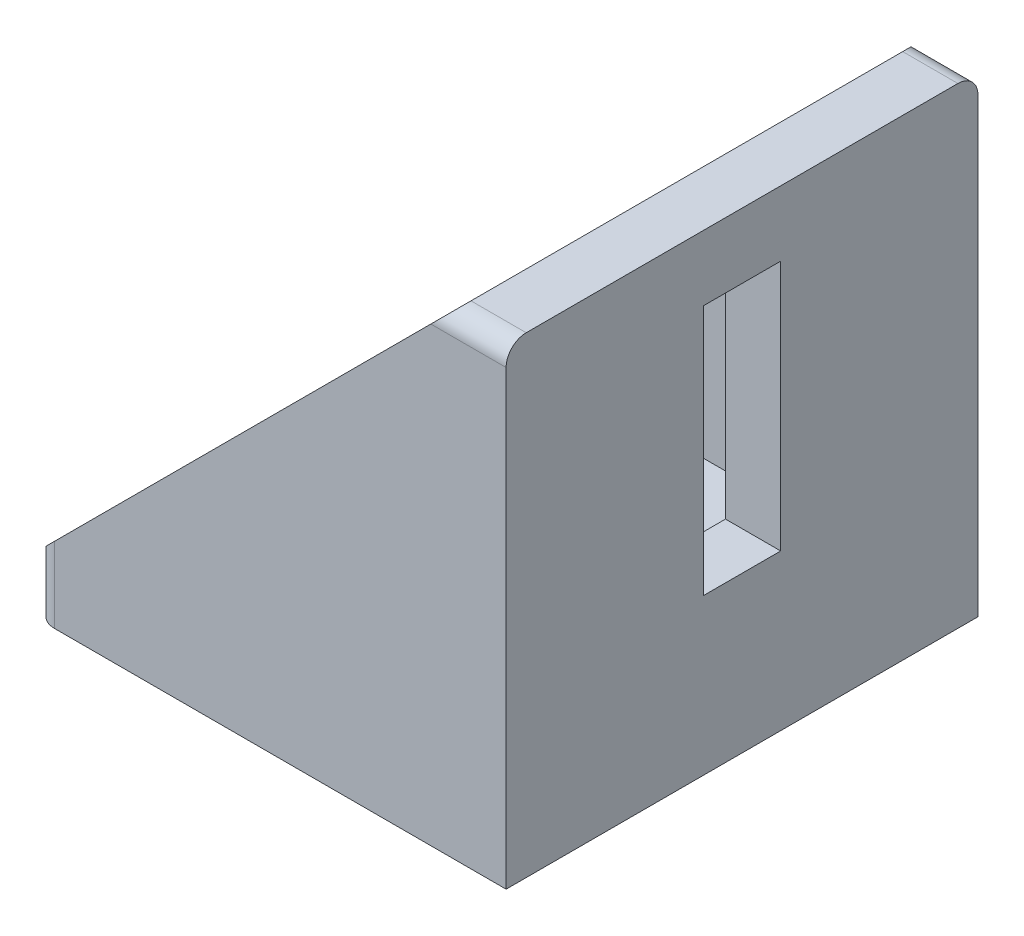
ISO-10303-21;
HEADER;
FILE_DESCRIPTION(('STEP AP214'),'2;1');
FILE_NAME('part.step','',(''),(''),'','','');
FILE_SCHEMA(('AUTOMOTIVE_DESIGN { 1 0 10303 214 1 1 1 1 }'));
ENDSEC;
DATA;
#1=APPLICATION_CONTEXT('core data for automotive mechanical design processes');
#2=APPLICATION_PROTOCOL_DEFINITION('international standard','automotive_design',2000,#1);
#3=PRODUCT_CONTEXT('',#1,'mechanical');
#4=PRODUCT('Part','Part','',(#3));
#5=PRODUCT_RELATED_PRODUCT_CATEGORY('part','',(#4));
#6=PRODUCT_DEFINITION_FORMATION('','',#4);
#7=PRODUCT_DEFINITION_CONTEXT('part definition',#1,'design');
#8=PRODUCT_DEFINITION('design','',#6,#7);
#9=PRODUCT_DEFINITION_SHAPE('','',#8);
#10=(LENGTH_UNIT() NAMED_UNIT(*) SI_UNIT(.MILLI.,.METRE.));
#11=(NAMED_UNIT(*) PLANE_ANGLE_UNIT() SI_UNIT($,.RADIAN.));
#12=(NAMED_UNIT(*) SI_UNIT($,.STERADIAN.) SOLID_ANGLE_UNIT());
#13=UNCERTAINTY_MEASURE_WITH_UNIT(LENGTH_MEASURE(1.E-05),#10,'distance_accuracy_value','');
#14=(GEOMETRIC_REPRESENTATION_CONTEXT(3) GLOBAL_UNCERTAINTY_ASSIGNED_CONTEXT((#13)) GLOBAL_UNIT_ASSIGNED_CONTEXT((#10,
#11,#12)) REPRESENTATION_CONTEXT('',''));
#15=CARTESIAN_POINT('',(0.,0.,0.));
#16=DIRECTION('',(0.,0.,1.));
#17=DIRECTION('',(1.,0.,0.));
#18=AXIS2_PLACEMENT_3D('',#15,#16,#17);
#19=CARTESIAN_POINT('',(-5.5,47.,23.5));
#20=DIRECTION('',(0.707106781186547,-0.707106781186547,0.));
#21=DIRECTION('',(0.707106781186548,0.707106781186548,0.));
#22=AXIS2_PLACEMENT_3D('',#19,#20,#21);
#23=PLANE('',#22);
#24=DIRECTION('',(0.,0.,-1.));
#25=VECTOR('',#24,1.);
#26=CARTESIAN_POINT('',(-47.,5.5,23.5));
#27=LINE('',#26,#25);
#28=CARTESIAN_POINT('',(-47.,5.5,21.5));
#29=VERTEX_POINT('',#28);
#30=CARTESIAN_POINT('',(-47.,5.5,18.));
#31=VERTEX_POINT('',#30);
#32=EDGE_CURVE('E333',#29,#31,#27,.T.);
#33=ORIENTED_EDGE('',*,*,#32,.F.);
#34=CARTESIAN_POINT('',(-45.,7.5,21.5));
#35=DIRECTION('',(0.707106781186547,-0.707106781186547,0.));
#36=DIRECTION('',(0.707106781186548,0.707106781186548,0.));
#37=AXIS2_PLACEMENT_3D('',#34,#35,#36);
#38=ELLIPSE('',#37,2.82842712474619,2.);
#39=CARTESIAN_POINT('',(-45.,7.50000000000001,23.5));
#40=VERTEX_POINT('',#39);
#41=EDGE_CURVE('E387',#29,#40,#38,.F.);
#42=ORIENTED_EDGE('',*,*,#41,.T.);
#43=DIRECTION('',(-0.707106781186547,-0.707106781186547,0.));
#44=VECTOR('',#43,1.);
#45=CARTESIAN_POINT('',(-5.5,47.,23.5));
#46=LINE('',#45,#44);
#47=CARTESIAN_POINT('',(-7.5,45.,23.5));
#48=VERTEX_POINT('',#47);
#49=EDGE_CURVE('E320',#48,#40,#46,.T.);
#50=ORIENTED_EDGE('',*,*,#49,.F.);
#51=CARTESIAN_POINT('',(-7.5,45.,21.5));
#52=DIRECTION('',(0.707106781186547,-0.707106781186547,0.));
#53=DIRECTION('',(0.707106781186548,0.707106781186548,0.));
#54=AXIS2_PLACEMENT_3D('',#51,#52,#53);
#55=ELLIPSE('',#54,2.82842712474619,2.);
#56=CARTESIAN_POINT('',(-5.5,47.,21.5));
#57=VERTEX_POINT('',#56);
#58=EDGE_CURVE('E384',#48,#57,#55,.F.);
#59=ORIENTED_EDGE('',*,*,#58,.T.);
#60=DIRECTION('',(0.,0.,-1.));
#61=VECTOR('',#60,1.);
#62=CARTESIAN_POINT('',(-5.5,47.,23.5));
#63=LINE('',#62,#61);
#64=CARTESIAN_POINT('',(-5.5,47.,18.));
#65=VERTEX_POINT('',#64);
#66=EDGE_CURVE('E337',#57,#65,#63,.T.);
#67=ORIENTED_EDGE('',*,*,#66,.T.);
#68=DIRECTION('',(-0.707106781186547,-0.707106781186547,0.));
#69=VECTOR('',#68,1.);
#70=CARTESIAN_POINT('',(-5.5,47.,18.));
#71=LINE('',#70,#69);
#72=EDGE_CURVE('E267',#65,#31,#71,.T.);
#73=ORIENTED_EDGE('',*,*,#72,.T.);
#74=EDGE_LOOP('',(#33,#42,#50,#59,#67,#73));
#75=FACE_BOUND('',#74,.T.);
#76=ADVANCED_FACE('F39',(#75),#23,.F.);
#77=CARTESIAN_POINT('',(-47.,5.5,23.5));
#78=DIRECTION('',(1.,0.,0.));
#79=DIRECTION('',(0.,0.,-1.));
#80=AXIS2_PLACEMENT_3D('',#77,#78,#79);
#81=PLANE('',#80);
#82=CARTESIAN_POINT('',(-47.,5.5,-18.));
#83=VERTEX_POINT('',#82);
#84=CARTESIAN_POINT('',(-47.,5.5,-21.5));
#85=VERTEX_POINT('',#84);
#86=EDGE_CURVE('E324',#83,#85,#27,.T.);
#87=ORIENTED_EDGE('',*,*,#86,.T.);
#88=DIRECTION('',(0.,-1.,0.));
#89=VECTOR('',#88,1.);
#90=CARTESIAN_POINT('',(-47.,5.5,-21.5));
#91=LINE('',#90,#89);
#92=CARTESIAN_POINT('',(-47.,0.,-21.5));
#93=VERTEX_POINT('',#92);
#94=EDGE_CURVE('E354',#85,#93,#91,.T.);
#95=ORIENTED_EDGE('',*,*,#94,.T.);
#96=DIRECTION('',(0.,0.,-1.));
#97=VECTOR('',#96,1.);
#98=CARTESIAN_POINT('',(-47.,0.,23.5));
#99=LINE('',#98,#97);
#100=CARTESIAN_POINT('',(-47.,0.,21.5));
#101=VERTEX_POINT('',#100);
#102=EDGE_CURVE('E347',#101,#93,#99,.T.);
#103=ORIENTED_EDGE('',*,*,#102,.F.);
#104=DIRECTION('',(0.,-1.,0.));
#105=VECTOR('',#104,1.);
#106=CARTESIAN_POINT('',(-47.,5.5,21.5));
#107=LINE('',#106,#105);
#108=EDGE_CURVE('E351',#101,#29,#107,.F.);
#109=ORIENTED_EDGE('',*,*,#108,.T.);
#110=ORIENTED_EDGE('',*,*,#32,.T.);
#111=DIRECTION('',(0.,0.,1.));
#112=VECTOR('',#111,1.);
#113=CARTESIAN_POINT('',(-47.,5.5,-18.));
#114=LINE('',#113,#112);
#115=EDGE_CURVE('E290',#83,#31,#114,.T.);
#116=ORIENTED_EDGE('',*,*,#115,.F.);
#117=EDGE_LOOP('',(#87,#95,#103,#109,#110,#116));
#118=FACE_BOUND('',#117,.T.);
#119=ADVANCED_FACE('F428',(#118),#81,.F.);
#120=CARTESIAN_POINT('',(-47.,0.,23.5));
#121=DIRECTION('',(0.,1.,0.));
#122=DIRECTION('',(0.,0.,1.));
#123=AXIS2_PLACEMENT_3D('',#120,#121,#122);
#124=PLANE('',#123);
#125=DIRECTION('',(1.,0.,0.));
#126=VECTOR('',#125,1.);
#127=CARTESIAN_POINT('',(-37.5,0.,3.85));
#128=LINE('',#127,#126);
#129=CARTESIAN_POINT('',(-37.5,0.,3.85));
#130=VERTEX_POINT('',#129);
#131=CARTESIAN_POINT('',(-12.5,0.,3.85));
#132=VERTEX_POINT('',#131);
#133=EDGE_CURVE('E190',#130,#132,#128,.T.);
#134=ORIENTED_EDGE('',*,*,#133,.T.);
#135=DIRECTION('',(0.,0.,-1.));
#136=VECTOR('',#135,1.);
#137=CARTESIAN_POINT('',(-12.5,0.,3.85));
#138=LINE('',#137,#136);
#139=CARTESIAN_POINT('',(-12.5,0.,-3.85));
#140=VERTEX_POINT('',#139);
#141=EDGE_CURVE('E181',#132,#140,#138,.T.);
#142=ORIENTED_EDGE('',*,*,#141,.T.);
#143=DIRECTION('',(-1.,0.,0.));
#144=VECTOR('',#143,1.);
#145=CARTESIAN_POINT('',(-37.5,0.,-3.85));
#146=LINE('',#145,#144);
#147=CARTESIAN_POINT('',(-37.5,0.,-3.85));
#148=VERTEX_POINT('',#147);
#149=EDGE_CURVE('E194',#140,#148,#146,.T.);
#150=ORIENTED_EDGE('',*,*,#149,.T.);
#151=DIRECTION('',(0.,0.,1.));
#152=VECTOR('',#151,1.);
#153=CARTESIAN_POINT('',(-37.5,0.,3.85));
#154=LINE('',#153,#152);
#155=EDGE_CURVE('E199',#148,#130,#154,.T.);
#156=ORIENTED_EDGE('',*,*,#155,.T.);
#157=EDGE_LOOP('',(#134,#142,#150,#156));
#158=FACE_BOUND('',#157,.T.);
#159=ORIENTED_EDGE('',*,*,#102,.T.);
#160=CARTESIAN_POINT('',(-45.,0.,-21.5));
#161=DIRECTION('',(0.,1.,0.));
#162=DIRECTION('',(0.,0.,1.));
#163=AXIS2_PLACEMENT_3D('',#160,#161,#162);
#164=CIRCLE('',#163,2.);
#165=CARTESIAN_POINT('',(-45.,0.,-23.5));
#166=VERTEX_POINT('',#165);
#167=EDGE_CURVE('E361',#93,#166,#164,.F.);
#168=ORIENTED_EDGE('',*,*,#167,.T.);
#169=DIRECTION('',(1.,0.,0.));
#170=VECTOR('',#169,1.);
#171=CARTESIAN_POINT('',(-47.,0.,-23.5));
#172=LINE('',#171,#170);
#173=CARTESIAN_POINT('',(0.,0.,-23.5));
#174=VERTEX_POINT('',#173);
#175=EDGE_CURVE('E305',#166,#174,#172,.T.);
#176=ORIENTED_EDGE('',*,*,#175,.T.);
#177=DIRECTION('',(0.,0.,-1.));
#178=VECTOR('',#177,1.);
#179=CARTESIAN_POINT('',(0.,0.,23.5));
#180=LINE('',#179,#178);
#181=CARTESIAN_POINT('',(0.,0.,23.5));
#182=VERTEX_POINT('',#181);
#183=EDGE_CURVE('E343',#182,#174,#180,.T.);
#184=ORIENTED_EDGE('',*,*,#183,.F.);
#185=DIRECTION('',(1.,0.,0.));
#186=VECTOR('',#185,1.);
#187=CARTESIAN_POINT('',(-47.,0.,23.5));
#188=LINE('',#187,#186);
#189=CARTESIAN_POINT('',(-45.,0.,23.5));
#190=VERTEX_POINT('',#189);
#191=EDGE_CURVE('E312',#190,#182,#188,.T.);
#192=ORIENTED_EDGE('',*,*,#191,.F.);
#193=CARTESIAN_POINT('',(-45.,0.,21.5));
#194=DIRECTION('',(0.,1.,0.));
#195=DIRECTION('',(0.,0.,1.));
#196=AXIS2_PLACEMENT_3D('',#193,#194,#195);
#197=CIRCLE('',#196,2.);
#198=EDGE_CURVE('E358',#190,#101,#197,.F.);
#199=ORIENTED_EDGE('',*,*,#198,.T.);
#200=EDGE_LOOP('',(#159,#168,#176,#184,#192,#199));
#201=FACE_BOUND('',#200,.T.);
#202=ADVANCED_FACE('F201',(#158,#201),#124,.F.);
#203=CARTESIAN_POINT('',(0.,0.,23.5));
#204=DIRECTION('',(-1.,0.,0.));
#205=DIRECTION('',(0.,0.,1.));
#206=AXIS2_PLACEMENT_3D('',#203,#204,#205);
#207=PLANE('',#206);
#208=DIRECTION('',(0.,0.,1.));
#209=VECTOR('',#208,1.);
#210=CARTESIAN_POINT('',(0.,15.5,-3.85));
#211=LINE('',#210,#209);
#212=CARTESIAN_POINT('',(0.,15.5,-3.85));
#213=VERTEX_POINT('',#212);
#214=CARTESIAN_POINT('',(0.,15.5,3.85));
#215=VERTEX_POINT('',#214);
#216=EDGE_CURVE('E246',#213,#215,#211,.T.);
#217=ORIENTED_EDGE('',*,*,#216,.T.);
#218=DIRECTION('',(0.,1.,0.));
#219=VECTOR('',#218,1.);
#220=CARTESIAN_POINT('',(0.,15.5,3.85));
#221=LINE('',#220,#219);
#222=CARTESIAN_POINT('',(0.,40.5,3.85));
#223=VERTEX_POINT('',#222);
#224=EDGE_CURVE('E233',#215,#223,#221,.T.);
#225=ORIENTED_EDGE('',*,*,#224,.T.);
#226=DIRECTION('',(0.,0.,-1.));
#227=VECTOR('',#226,1.);
#228=CARTESIAN_POINT('',(0.,40.5,-3.85));
#229=LINE('',#228,#227);
#230=CARTESIAN_POINT('',(0.,40.5,-3.85));
#231=VERTEX_POINT('',#230);
#232=EDGE_CURVE('E237',#223,#231,#229,.T.);
#233=ORIENTED_EDGE('',*,*,#232,.T.);
#234=DIRECTION('',(0.,-1.,0.));
#235=VECTOR('',#234,1.);
#236=CARTESIAN_POINT('',(0.,15.5,-3.85));
#237=LINE('',#236,#235);
#238=EDGE_CURVE('E242',#231,#213,#237,.T.);
#239=ORIENTED_EDGE('',*,*,#238,.T.);
#240=EDGE_LOOP('',(#217,#225,#233,#239));
#241=FACE_BOUND('',#240,.T.);
#242=DIRECTION('',(0.,1.,0.));
#243=VECTOR('',#242,1.);
#244=CARTESIAN_POINT('',(0.,0.,-23.5));
#245=LINE('',#244,#243);
#246=CARTESIAN_POINT('',(0.,45.,-23.5));
#247=VERTEX_POINT('',#246);
#248=EDGE_CURVE('E327',#174,#247,#245,.T.);
#249=ORIENTED_EDGE('',*,*,#248,.T.);
#250=CARTESIAN_POINT('',(0.,45.,-21.5));
#251=DIRECTION('',(-1.,0.,0.));
#252=DIRECTION('',(0.,0.,1.));
#253=AXIS2_PLACEMENT_3D('',#250,#251,#252);
#254=CIRCLE('',#253,2.);
#255=CARTESIAN_POINT('',(0.,47.,-21.5));
#256=VERTEX_POINT('',#255);
#257=EDGE_CURVE('E11',#247,#256,#254,.F.);
#258=ORIENTED_EDGE('',*,*,#257,.T.);
#259=DIRECTION('',(0.,0.,-1.));
#260=VECTOR('',#259,1.);
#261=CARTESIAN_POINT('',(0.,47.,23.5));
#262=LINE('',#261,#260);
#263=CARTESIAN_POINT('',(0.,47.,21.5));
#264=VERTEX_POINT('',#263);
#265=EDGE_CURVE('E340',#264,#256,#262,.T.);
#266=ORIENTED_EDGE('',*,*,#265,.F.);
#267=CARTESIAN_POINT('',(0.,45.,21.5));
#268=DIRECTION('',(-1.,0.,0.));
#269=DIRECTION('',(0.,0.,1.));
#270=AXIS2_PLACEMENT_3D('',#267,#268,#269);
#271=CIRCLE('',#270,2.);
#272=CARTESIAN_POINT('',(0.,45.,23.5));
#273=VERTEX_POINT('',#272);
#274=EDGE_CURVE('E48',#264,#273,#271,.F.);
#275=ORIENTED_EDGE('',*,*,#274,.T.);
#276=DIRECTION('',(0.,1.,0.));
#277=VECTOR('',#276,1.);
#278=CARTESIAN_POINT('',(0.,0.,23.5));
#279=LINE('',#278,#277);
#280=EDGE_CURVE('E315',#182,#273,#279,.T.);
#281=ORIENTED_EDGE('',*,*,#280,.F.);
#282=ORIENTED_EDGE('',*,*,#183,.T.);
#283=EDGE_LOOP('',(#249,#258,#266,#275,#281,#282));
#284=FACE_BOUND('',#283,.T.);
#285=ADVANCED_FACE('F398',(#241,#284),#207,.F.);
#286=CARTESIAN_POINT('',(0.,47.,23.5));
#287=DIRECTION('',(0.,-1.,0.));
#288=DIRECTION('',(0.,0.,-1.));
#289=AXIS2_PLACEMENT_3D('',#286,#287,#288);
#290=PLANE('',#289);
#291=ORIENTED_EDGE('',*,*,#265,.T.);
#292=DIRECTION('',(-1.,0.,0.));
#293=VECTOR('',#292,1.);
#294=CARTESIAN_POINT('',(0.,47.,-21.5));
#295=LINE('',#294,#293);
#296=CARTESIAN_POINT('',(-5.5,47.,-21.5));
#297=VERTEX_POINT('',#296);
#298=EDGE_CURVE('E392',#256,#297,#295,.T.);
#299=ORIENTED_EDGE('',*,*,#298,.T.);
#300=CARTESIAN_POINT('',(-5.5,47.,-18.));
#301=VERTEX_POINT('',#300);
#302=EDGE_CURVE('E336',#301,#297,#63,.T.);
#303=ORIENTED_EDGE('',*,*,#302,.F.);
#304=DIRECTION('',(0.,0.,1.));
#305=VECTOR('',#304,1.);
#306=CARTESIAN_POINT('',(-5.5,47.,-18.));
#307=LINE('',#306,#305);
#308=EDGE_CURVE('E301',#301,#65,#307,.T.);
#309=ORIENTED_EDGE('',*,*,#308,.T.);
#310=ORIENTED_EDGE('',*,*,#66,.F.);
#311=DIRECTION('',(-1.,0.,0.));
#312=VECTOR('',#311,1.);
#313=CARTESIAN_POINT('',(0.,47.,21.5));
#314=LINE('',#313,#312);
#315=EDGE_CURVE('E60',#57,#264,#314,.F.);
#316=ORIENTED_EDGE('',*,*,#315,.T.);
#317=EDGE_LOOP('',(#291,#299,#303,#309,#310,#316));
#318=FACE_BOUND('',#317,.T.);
#319=ADVANCED_FACE('F409',(#318),#290,.F.);
#320=DIRECTION('',(-0.707106781186547,-0.707106781186547,0.));
#321=VECTOR('',#320,1.);
#322=CARTESIAN_POINT('',(-5.5,47.,-23.5));
#323=LINE('',#322,#321);
#324=CARTESIAN_POINT('',(-7.5,45.,-23.5));
#325=VERTEX_POINT('',#324);
#326=CARTESIAN_POINT('',(-45.,7.50000000000001,-23.5));
#327=VERTEX_POINT('',#326);
#328=EDGE_CURVE('E316',#325,#327,#323,.T.);
#329=ORIENTED_EDGE('',*,*,#328,.T.);
#330=CARTESIAN_POINT('',(-45.,7.5,-21.5));
#331=DIRECTION('',(0.707106781186547,-0.707106781186547,0.));
#332=DIRECTION('',(-0.707106781186548,-0.707106781186548,0.));
#333=AXIS2_PLACEMENT_3D('',#330,#331,#332);
#334=ELLIPSE('',#333,2.82842712474619,2.);
#335=EDGE_CURVE('E373',#327,#85,#334,.F.);
#336=ORIENTED_EDGE('',*,*,#335,.T.);
#337=ORIENTED_EDGE('',*,*,#86,.F.);
#338=DIRECTION('',(-0.707106781186547,-0.707106781186547,0.));
#339=VECTOR('',#338,1.);
#340=CARTESIAN_POINT('',(-5.5,47.,-18.));
#341=LINE('',#340,#339);
#342=EDGE_CURVE('E277',#301,#83,#341,.T.);
#343=ORIENTED_EDGE('',*,*,#342,.F.);
#344=ORIENTED_EDGE('',*,*,#302,.T.);
#345=CARTESIAN_POINT('',(-7.5,45.,-21.5));
#346=DIRECTION('',(0.707106781186547,-0.707106781186547,0.));
#347=DIRECTION('',(-0.707106781186548,-0.707106781186548,0.));
#348=AXIS2_PLACEMENT_3D('',#345,#346,#347);
#349=ELLIPSE('',#348,2.82842712474619,2.);
#350=EDGE_CURVE('E370',#297,#325,#349,.F.);
#351=ORIENTED_EDGE('',*,*,#350,.T.);
#352=EDGE_LOOP('',(#329,#336,#337,#343,#344,#351));
#353=FACE_BOUND('',#352,.T.);
#354=ADVANCED_FACE('F421',(#353),#23,.F.);
#355=CARTESIAN_POINT('',(0.,0.,23.5));
#356=DIRECTION('',(0.,0.,1.));
#357=DIRECTION('',(1.,0.,0.));
#358=AXIS2_PLACEMENT_3D('',#355,#356,#357);
#359=PLANE('',#358);
#360=ORIENTED_EDGE('',*,*,#49,.T.);
#361=DIRECTION('',(0.,-1.,0.));
#362=VECTOR('',#361,1.);
#363=CARTESIAN_POINT('',(-45.,0.,23.5));
#364=LINE('',#363,#362);
#365=EDGE_CURVE('E380',#40,#190,#364,.T.);
#366=ORIENTED_EDGE('',*,*,#365,.T.);
#367=ORIENTED_EDGE('',*,*,#191,.T.);
#368=ORIENTED_EDGE('',*,*,#280,.T.);
#369=DIRECTION('',(-1.,0.,0.));
#370=VECTOR('',#369,1.);
#371=CARTESIAN_POINT('',(-5.5,45.,23.5));
#372=LINE('',#371,#370);
#373=EDGE_CURVE('E376',#273,#48,#372,.T.);
#374=ORIENTED_EDGE('',*,*,#373,.T.);
#375=EDGE_LOOP('',(#360,#366,#367,#368,#374));
#376=FACE_BOUND('',#375,.T.);
#377=ADVANCED_FACE('F402',(#376),#359,.T.);
#378=CARTESIAN_POINT('',(0.,0.,-23.5));
#379=DIRECTION('',(0.,0.,1.));
#380=DIRECTION('',(1.,0.,0.));
#381=AXIS2_PLACEMENT_3D('',#378,#379,#380);
#382=PLANE('',#381);
#383=ORIENTED_EDGE('',*,*,#175,.F.);
#384=DIRECTION('',(0.,-1.,0.));
#385=VECTOR('',#384,1.);
#386=CARTESIAN_POINT('',(-45.,0.,-23.5));
#387=LINE('',#386,#385);
#388=EDGE_CURVE('E367',#166,#327,#387,.F.);
#389=ORIENTED_EDGE('',*,*,#388,.T.);
#390=ORIENTED_EDGE('',*,*,#328,.F.);
#391=DIRECTION('',(-1.,0.,0.));
#392=VECTOR('',#391,1.);
#393=CARTESIAN_POINT('',(0.,45.,-23.5));
#394=LINE('',#393,#392);
#395=EDGE_CURVE('E364',#325,#247,#394,.F.);
#396=ORIENTED_EDGE('',*,*,#395,.T.);
#397=ORIENTED_EDGE('',*,*,#248,.F.);
#398=EDGE_LOOP('',(#383,#389,#390,#396,#397));
#399=FACE_BOUND('',#398,.T.);
#400=ADVANCED_FACE('F460',(#399),#382,.F.);
#401=CARTESIAN_POINT('',(-5.5,47.,-18.));
#402=DIRECTION('',(1.,0.,0.));
#403=DIRECTION('',(0.,0.,-1.));
#404=AXIS2_PLACEMENT_3D('',#401,#402,#403);
#405=PLANE('',#404);
#406=DIRECTION('',(0.,0.,-1.));
#407=VECTOR('',#406,1.);
#408=CARTESIAN_POINT('',(-5.5,40.5,-3.85));
#409=LINE('',#408,#407);
#410=CARTESIAN_POINT('',(-5.5,40.5,3.85));
#411=VERTEX_POINT('',#410);
#412=CARTESIAN_POINT('',(-5.5,40.5,-3.85));
#413=VERTEX_POINT('',#412);
#414=EDGE_CURVE('E253',#411,#413,#409,.T.);
#415=ORIENTED_EDGE('',*,*,#414,.F.);
#416=DIRECTION('',(0.,1.,0.));
#417=VECTOR('',#416,1.);
#418=CARTESIAN_POINT('',(-5.5,15.5,3.85));
#419=LINE('',#418,#417);
#420=CARTESIAN_POINT('',(-5.5,15.5,3.85));
#421=VERTEX_POINT('',#420);
#422=EDGE_CURVE('E227',#421,#411,#419,.T.);
#423=ORIENTED_EDGE('',*,*,#422,.F.);
#424=DIRECTION('',(0.,0.,1.));
#425=VECTOR('',#424,1.);
#426=CARTESIAN_POINT('',(-5.5,15.5,-3.85));
#427=LINE('',#426,#425);
#428=CARTESIAN_POINT('',(-5.5,15.5,-3.85));
#429=VERTEX_POINT('',#428);
#430=EDGE_CURVE('E238',#429,#421,#427,.T.);
#431=ORIENTED_EDGE('',*,*,#430,.F.);
#432=DIRECTION('',(0.,-1.,0.));
#433=VECTOR('',#432,1.);
#434=CARTESIAN_POINT('',(-5.5,15.5,-3.85));
#435=LINE('',#434,#433);
#436=EDGE_CURVE('E257',#413,#429,#435,.T.);
#437=ORIENTED_EDGE('',*,*,#436,.F.);
#438=EDGE_LOOP('',(#415,#423,#431,#437));
#439=FACE_BOUND('',#438,.T.);
#440=DIRECTION('',(0.,1.,0.));
#441=VECTOR('',#440,1.);
#442=CARTESIAN_POINT('',(-5.5,47.,18.));
#443=LINE('',#442,#441);
#444=CARTESIAN_POINT('',(-5.5,5.5,18.));
#445=VERTEX_POINT('',#444);
#446=EDGE_CURVE('E282',#445,#65,#443,.T.);
#447=ORIENTED_EDGE('',*,*,#446,.T.);
#448=ORIENTED_EDGE('',*,*,#308,.F.);
#449=DIRECTION('',(0.,1.,0.));
#450=VECTOR('',#449,1.);
#451=CARTESIAN_POINT('',(-5.5,47.,-18.));
#452=LINE('',#451,#450);
#453=CARTESIAN_POINT('',(-5.5,5.5,-18.));
#454=VERTEX_POINT('',#453);
#455=EDGE_CURVE('E286',#454,#301,#452,.T.);
#456=ORIENTED_EDGE('',*,*,#455,.F.);
#457=DIRECTION('',(0.,0.,1.));
#458=VECTOR('',#457,1.);
#459=CARTESIAN_POINT('',(-5.5,5.5,-18.));
#460=LINE('',#459,#458);
#461=EDGE_CURVE('E306',#454,#445,#460,.T.);
#462=ORIENTED_EDGE('',*,*,#461,.T.);
#463=EDGE_LOOP('',(#447,#448,#456,#462));
#464=FACE_BOUND('',#463,.T.);
#465=ADVANCED_FACE('F414',(#439,#464),#405,.F.);
#466=CARTESIAN_POINT('',(-5.5,5.5,-18.));
#467=DIRECTION('',(0.,-1.,0.));
#468=DIRECTION('',(0.,0.,-1.));
#469=AXIS2_PLACEMENT_3D('',#466,#467,#468);
#470=PLANE('',#469);
#471=DIRECTION('',(-1.,0.,0.));
#472=VECTOR('',#471,1.);
#473=CARTESIAN_POINT('',(-37.5,5.5,-3.85));
#474=LINE('',#473,#472);
#475=CARTESIAN_POINT('',(-12.5,5.5,-3.85));
#476=VERTEX_POINT('',#475);
#477=CARTESIAN_POINT('',(-37.5,5.5,-3.85));
#478=VERTEX_POINT('',#477);
#479=EDGE_CURVE('E218',#476,#478,#474,.T.);
#480=ORIENTED_EDGE('',*,*,#479,.F.);
#481=DIRECTION('',(0.,0.,-1.));
#482=VECTOR('',#481,1.);
#483=CARTESIAN_POINT('',(-12.5,5.5,3.85));
#484=LINE('',#483,#482);
#485=CARTESIAN_POINT('',(-12.5,5.5,3.85));
#486=VERTEX_POINT('',#485);
#487=EDGE_CURVE('E184',#486,#476,#484,.T.);
#488=ORIENTED_EDGE('',*,*,#487,.F.);
#489=DIRECTION('',(1.,0.,0.));
#490=VECTOR('',#489,1.);
#491=CARTESIAN_POINT('',(-37.5,5.5,3.85));
#492=LINE('',#491,#490);
#493=CARTESIAN_POINT('',(-37.5,5.5,3.85));
#494=VERTEX_POINT('',#493);
#495=EDGE_CURVE('E205',#494,#486,#492,.T.);
#496=ORIENTED_EDGE('',*,*,#495,.F.);
#497=DIRECTION('',(0.,0.,1.));
#498=VECTOR('',#497,1.);
#499=CARTESIAN_POINT('',(-37.5,5.5,3.85));
#500=LINE('',#499,#498);
#501=EDGE_CURVE('E209',#478,#494,#500,.T.);
#502=ORIENTED_EDGE('',*,*,#501,.F.);
#503=EDGE_LOOP('',(#480,#488,#496,#502));
#504=FACE_BOUND('',#503,.T.);
#505=DIRECTION('',(1.,0.,0.));
#506=VECTOR('',#505,1.);
#507=CARTESIAN_POINT('',(-5.5,5.5,18.));
#508=LINE('',#507,#506);
#509=EDGE_CURVE('E294',#31,#445,#508,.T.);
#510=ORIENTED_EDGE('',*,*,#509,.T.);
#511=ORIENTED_EDGE('',*,*,#461,.F.);
#512=DIRECTION('',(1.,0.,0.));
#513=VECTOR('',#512,1.);
#514=CARTESIAN_POINT('',(-5.5,5.5,-18.));
#515=LINE('',#514,#513);
#516=EDGE_CURVE('E281',#83,#454,#515,.T.);
#517=ORIENTED_EDGE('',*,*,#516,.F.);
#518=ORIENTED_EDGE('',*,*,#115,.T.);
#519=EDGE_LOOP('',(#510,#511,#517,#518));
#520=FACE_BOUND('',#519,.T.);
#521=ADVANCED_FACE('F431',(#504,#520),#470,.F.);
#522=CARTESIAN_POINT('',(0.,0.,-18.));
#523=DIRECTION('',(0.,0.,-1.));
#524=DIRECTION('',(-1.,0.,0.));
#525=AXIS2_PLACEMENT_3D('',#522,#523,#524);
#526=PLANE('',#525);
#527=ORIENTED_EDGE('',*,*,#342,.T.);
#528=ORIENTED_EDGE('',*,*,#516,.T.);
#529=ORIENTED_EDGE('',*,*,#455,.T.);
#530=EDGE_LOOP('',(#527,#528,#529));
#531=FACE_BOUND('',#530,.T.);
#532=ADVANCED_FACE('F418',(#531),#526,.F.);
#533=CARTESIAN_POINT('',(0.,0.,18.));
#534=DIRECTION('',(0.,0.,-1.));
#535=DIRECTION('',(-1.,0.,0.));
#536=AXIS2_PLACEMENT_3D('',#533,#534,#535);
#537=PLANE('',#536);
#538=ORIENTED_EDGE('',*,*,#72,.F.);
#539=ORIENTED_EDGE('',*,*,#446,.F.);
#540=ORIENTED_EDGE('',*,*,#509,.F.);
#541=EDGE_LOOP('',(#538,#539,#540));
#542=FACE_BOUND('',#541,.T.);
#543=ADVANCED_FACE('F434',(#542),#537,.T.);
#544=CARTESIAN_POINT('',(0.,15.5,3.85));
#545=DIRECTION('',(0.,0.,1.));
#546=DIRECTION('',(1.,0.,0.));
#547=AXIS2_PLACEMENT_3D('',#544,#545,#546);
#548=PLANE('',#547);
#549=ORIENTED_EDGE('',*,*,#422,.T.);
#550=DIRECTION('',(-1.,0.,0.));
#551=VECTOR('',#550,1.);
#552=CARTESIAN_POINT('',(0.,40.5,3.85));
#553=LINE('',#552,#551);
#554=EDGE_CURVE('E250',#223,#411,#553,.T.);
#555=ORIENTED_EDGE('',*,*,#554,.F.);
#556=ORIENTED_EDGE('',*,*,#224,.F.);
#557=DIRECTION('',(-1.,0.,0.));
#558=VECTOR('',#557,1.);
#559=CARTESIAN_POINT('',(0.,15.5,3.85));
#560=LINE('',#559,#558);
#561=EDGE_CURVE('E264',#215,#421,#560,.T.);
#562=ORIENTED_EDGE('',*,*,#561,.T.);
#563=EDGE_LOOP('',(#549,#555,#556,#562));
#564=FACE_BOUND('',#563,.T.);
#565=ADVANCED_FACE('F436',(#564),#548,.F.);
#566=CARTESIAN_POINT('',(0.,15.5,-3.85));
#567=DIRECTION('',(0.,-1.,0.));
#568=DIRECTION('',(0.,0.,-1.));
#569=AXIS2_PLACEMENT_3D('',#566,#567,#568);
#570=PLANE('',#569);
#571=ORIENTED_EDGE('',*,*,#430,.T.);
#572=ORIENTED_EDGE('',*,*,#561,.F.);
#573=ORIENTED_EDGE('',*,*,#216,.F.);
#574=DIRECTION('',(-1.,0.,0.));
#575=VECTOR('',#574,1.);
#576=CARTESIAN_POINT('',(0.,15.5,-3.85));
#577=LINE('',#576,#575);
#578=EDGE_CURVE('E268',#213,#429,#577,.T.);
#579=ORIENTED_EDGE('',*,*,#578,.T.);
#580=EDGE_LOOP('',(#571,#572,#573,#579));
#581=FACE_BOUND('',#580,.T.);
#582=ADVANCED_FACE('F442',(#581),#570,.F.);
#583=CARTESIAN_POINT('',(0.,15.5,-3.85));
#584=DIRECTION('',(0.,0.,-1.));
#585=DIRECTION('',(-1.,0.,0.));
#586=AXIS2_PLACEMENT_3D('',#583,#584,#585);
#587=PLANE('',#586);
#588=ORIENTED_EDGE('',*,*,#436,.T.);
#589=ORIENTED_EDGE('',*,*,#578,.F.);
#590=ORIENTED_EDGE('',*,*,#238,.F.);
#591=DIRECTION('',(-1.,0.,0.));
#592=VECTOR('',#591,1.);
#593=CARTESIAN_POINT('',(0.,40.5,-3.85));
#594=LINE('',#593,#592);
#595=EDGE_CURVE('E271',#231,#413,#594,.T.);
#596=ORIENTED_EDGE('',*,*,#595,.T.);
#597=EDGE_LOOP('',(#588,#589,#590,#596));
#598=FACE_BOUND('',#597,.T.);
#599=ADVANCED_FACE('F523',(#598),#587,.F.);
#600=CARTESIAN_POINT('',(0.,40.5,-3.85));
#601=DIRECTION('',(0.,1.,0.));
#602=DIRECTION('',(0.,0.,1.));
#603=AXIS2_PLACEMENT_3D('',#600,#601,#602);
#604=PLANE('',#603);
#605=ORIENTED_EDGE('',*,*,#414,.T.);
#606=ORIENTED_EDGE('',*,*,#595,.F.);
#607=ORIENTED_EDGE('',*,*,#232,.F.);
#608=ORIENTED_EDGE('',*,*,#554,.T.);
#609=EDGE_LOOP('',(#605,#606,#607,#608));
#610=FACE_BOUND('',#609,.T.);
#611=ADVANCED_FACE('F516',(#610),#604,.F.);
#612=CARTESIAN_POINT('',(-12.5,0.,3.85));
#613=DIRECTION('',(1.,0.,0.));
#614=DIRECTION('',(0.,0.,-1.));
#615=AXIS2_PLACEMENT_3D('',#612,#613,#614);
#616=PLANE('',#615);
#617=ORIENTED_EDGE('',*,*,#487,.T.);
#618=DIRECTION('',(0.,1.,0.));
#619=VECTOR('',#618,1.);
#620=CARTESIAN_POINT('',(-12.5,0.,-3.85));
#621=LINE('',#620,#619);
#622=EDGE_CURVE('E177',#140,#476,#621,.T.);
#623=ORIENTED_EDGE('',*,*,#622,.F.);
#624=ORIENTED_EDGE('',*,*,#141,.F.);
#625=DIRECTION('',(0.,1.,0.));
#626=VECTOR('',#625,1.);
#627=CARTESIAN_POINT('',(-12.5,0.,3.85));
#628=LINE('',#627,#626);
#629=EDGE_CURVE('E224',#132,#486,#628,.T.);
#630=ORIENTED_EDGE('',*,*,#629,.T.);
#631=EDGE_LOOP('',(#617,#623,#624,#630));
#632=FACE_BOUND('',#631,.T.);
#633=ADVANCED_FACE('F179',(#632),#616,.F.);
#634=CARTESIAN_POINT('',(-37.5,0.,3.85));
#635=DIRECTION('',(0.,0.,1.));
#636=DIRECTION('',(1.,0.,0.));
#637=AXIS2_PLACEMENT_3D('',#634,#635,#636);
#638=PLANE('',#637);
#639=ORIENTED_EDGE('',*,*,#495,.T.);
#640=ORIENTED_EDGE('',*,*,#629,.F.);
#641=ORIENTED_EDGE('',*,*,#133,.F.);
#642=DIRECTION('',(0.,1.,0.));
#643=VECTOR('',#642,1.);
#644=CARTESIAN_POINT('',(-37.5,0.,3.85));
#645=LINE('',#644,#643);
#646=EDGE_CURVE('E228',#130,#494,#645,.T.);
#647=ORIENTED_EDGE('',*,*,#646,.T.);
#648=EDGE_LOOP('',(#639,#640,#641,#647));
#649=FACE_BOUND('',#648,.T.);
#650=ADVANCED_FACE('F508',(#649),#638,.F.);
#651=CARTESIAN_POINT('',(-37.5,0.,3.85));
#652=DIRECTION('',(-1.,0.,0.));
#653=DIRECTION('',(0.,0.,1.));
#654=AXIS2_PLACEMENT_3D('',#651,#652,#653);
#655=PLANE('',#654);
#656=ORIENTED_EDGE('',*,*,#501,.T.);
#657=ORIENTED_EDGE('',*,*,#646,.F.);
#658=ORIENTED_EDGE('',*,*,#155,.F.);
#659=DIRECTION('',(0.,1.,0.));
#660=VECTOR('',#659,1.);
#661=CARTESIAN_POINT('',(-37.5,0.,-3.85));
#662=LINE('',#661,#660);
#663=EDGE_CURVE('E189',#148,#478,#662,.T.);
#664=ORIENTED_EDGE('',*,*,#663,.T.);
#665=EDGE_LOOP('',(#656,#657,#658,#664));
#666=FACE_BOUND('',#665,.T.);
#667=ADVANCED_FACE('F506',(#666),#655,.F.);
#668=CARTESIAN_POINT('',(-37.5,0.,-3.85));
#669=DIRECTION('',(0.,0.,-1.));
#670=DIRECTION('',(-1.,0.,0.));
#671=AXIS2_PLACEMENT_3D('',#668,#669,#670);
#672=PLANE('',#671);
#673=ORIENTED_EDGE('',*,*,#479,.T.);
#674=ORIENTED_EDGE('',*,*,#663,.F.);
#675=ORIENTED_EDGE('',*,*,#149,.F.);
#676=ORIENTED_EDGE('',*,*,#622,.T.);
#677=EDGE_LOOP('',(#673,#674,#675,#676));
#678=FACE_BOUND('',#677,.T.);
#679=ADVANCED_FACE('F195',(#678),#672,.F.);
#680=CARTESIAN_POINT('',(-45.,5.5,-21.5));
#681=DIRECTION('',(0.,-1.,0.));
#682=DIRECTION('',(0.,0.,-1.));
#683=AXIS2_PLACEMENT_3D('',#680,#681,#682);
#684=CYLINDRICAL_SURFACE('',#683,2.);
#685=ORIENTED_EDGE('',*,*,#335,.F.);
#686=ORIENTED_EDGE('',*,*,#388,.F.);
#687=ORIENTED_EDGE('',*,*,#167,.F.);
#688=ORIENTED_EDGE('',*,*,#94,.F.);
#689=EDGE_LOOP('',(#685,#686,#687,#688));
#690=FACE_BOUND('',#689,.T.);
#691=ADVANCED_FACE('F470',(#690),#684,.T.);
#692=CARTESIAN_POINT('',(-45.,0.,21.5));
#693=DIRECTION('',(0.,1.,0.));
#694=DIRECTION('',(0.,0.,1.));
#695=AXIS2_PLACEMENT_3D('',#692,#693,#694);
#696=CYLINDRICAL_SURFACE('',#695,2.);
#697=ORIENTED_EDGE('',*,*,#41,.F.);
#698=ORIENTED_EDGE('',*,*,#108,.F.);
#699=ORIENTED_EDGE('',*,*,#198,.F.);
#700=ORIENTED_EDGE('',*,*,#365,.F.);
#701=EDGE_LOOP('',(#697,#698,#699,#700));
#702=FACE_BOUND('',#701,.T.);
#703=ADVANCED_FACE('F473',(#702),#696,.T.);
#704=CARTESIAN_POINT('',(0.,45.,-21.5));
#705=DIRECTION('',(-1.,0.,0.));
#706=DIRECTION('',(0.,0.,1.));
#707=AXIS2_PLACEMENT_3D('',#704,#705,#706);
#708=CYLINDRICAL_SURFACE('',#707,2.);
#709=ORIENTED_EDGE('',*,*,#257,.F.);
#710=ORIENTED_EDGE('',*,*,#395,.F.);
#711=ORIENTED_EDGE('',*,*,#350,.F.);
#712=ORIENTED_EDGE('',*,*,#298,.F.);
#713=EDGE_LOOP('',(#709,#710,#711,#712));
#714=FACE_BOUND('',#713,.T.);
#715=ADVANCED_FACE('F476',(#714),#708,.T.);
#716=CARTESIAN_POINT('',(0.,45.,21.5));
#717=DIRECTION('',(1.,0.,0.));
#718=DIRECTION('',(0.,0.,-1.));
#719=AXIS2_PLACEMENT_3D('',#716,#717,#718);
#720=CYLINDRICAL_SURFACE('',#719,2.);
#721=ORIENTED_EDGE('',*,*,#274,.F.);
#722=ORIENTED_EDGE('',*,*,#315,.F.);
#723=ORIENTED_EDGE('',*,*,#58,.F.);
#724=ORIENTED_EDGE('',*,*,#373,.F.);
#725=EDGE_LOOP('',(#721,#722,#723,#724));
#726=FACE_BOUND('',#725,.T.);
#727=ADVANCED_FACE('F41',(#726),#720,.T.);
#728=CLOSED_SHELL('',(#76,#119,#202,#285,#319,#354,#377,#400,#465,#521,#532,#543,#565,#582,#599,
#611,#633,#650,#667,#679,#691,#703,#715,#727));
#729=MANIFOLD_SOLID_BREP('B2',#728);
#730=ADVANCED_BREP_SHAPE_REPRESENTATION('',(#18,#729),#14);
#731=SHAPE_DEFINITION_REPRESENTATION(#9,#730);
ENDSEC;
END-ISO-10303-21;
